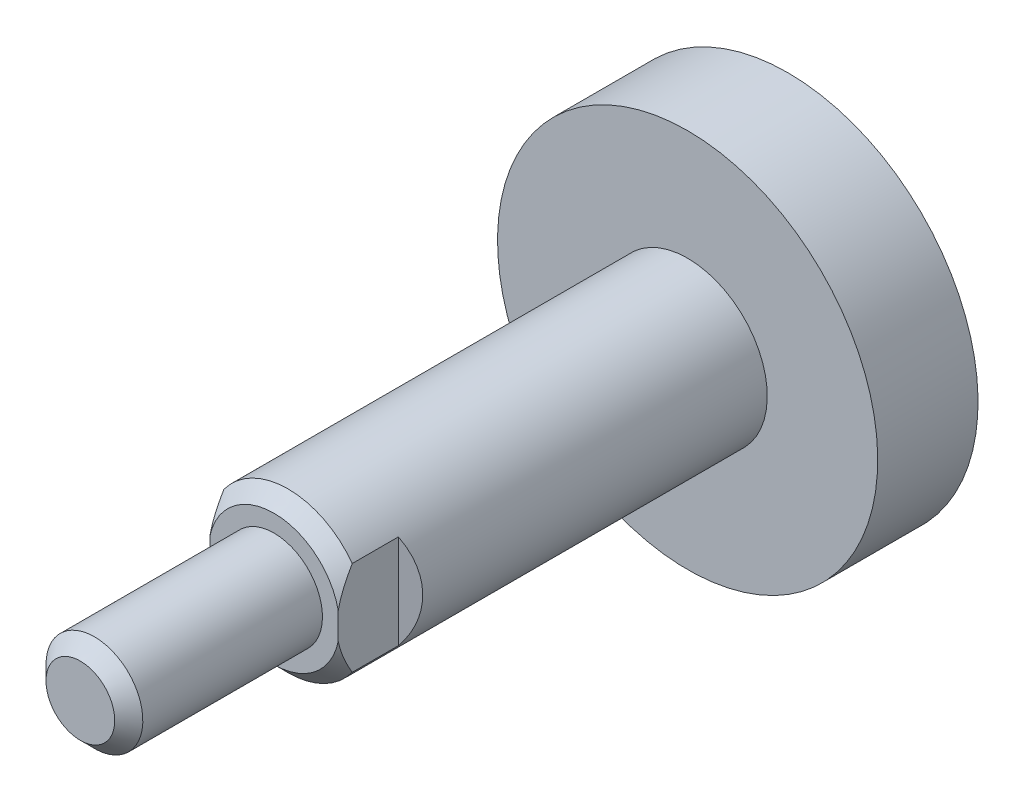
ISO-10303-21;
HEADER;
FILE_DESCRIPTION(('STEP AP214'),'2;1');
FILE_NAME('part.step','',(''),(''),'','','');
FILE_SCHEMA(('AUTOMOTIVE_DESIGN { 1 0 10303 214 1 1 1 1 }'));
ENDSEC;
DATA;
#1=APPLICATION_CONTEXT('core data for automotive mechanical design processes');
#2=APPLICATION_PROTOCOL_DEFINITION('international standard','automotive_design',2000,#1);
#3=PRODUCT_CONTEXT('',#1,'mechanical');
#4=PRODUCT('Part','Part','',(#3));
#5=PRODUCT_RELATED_PRODUCT_CATEGORY('part','',(#4));
#6=PRODUCT_DEFINITION_FORMATION('','',#4);
#7=PRODUCT_DEFINITION_CONTEXT('part definition',#1,'design');
#8=PRODUCT_DEFINITION('design','',#6,#7);
#9=PRODUCT_DEFINITION_SHAPE('','',#8);
#10=(LENGTH_UNIT() NAMED_UNIT(*) SI_UNIT(.MILLI.,.METRE.));
#11=(NAMED_UNIT(*) PLANE_ANGLE_UNIT() SI_UNIT($,.RADIAN.));
#12=(NAMED_UNIT(*) SI_UNIT($,.STERADIAN.) SOLID_ANGLE_UNIT());
#13=UNCERTAINTY_MEASURE_WITH_UNIT(LENGTH_MEASURE(1.E-05),#10,'distance_accuracy_value','');
#14=(GEOMETRIC_REPRESENTATION_CONTEXT(3) GLOBAL_UNCERTAINTY_ASSIGNED_CONTEXT((#13)) GLOBAL_UNIT_ASSIGNED_CONTEXT((#10,
#11,#12)) REPRESENTATION_CONTEXT('',''));
#15=CARTESIAN_POINT('',(0.,0.,0.));
#16=DIRECTION('',(0.,0.,1.));
#17=DIRECTION('',(1.,0.,0.));
#18=AXIS2_PLACEMENT_3D('',#15,#16,#17);
#19=CARTESIAN_POINT('',(0.,0.,35.266));
#20=DIRECTION('',(0.,0.,1.));
#21=DIRECTION('',(0.,-1.,0.));
#22=AXIS2_PLACEMENT_3D('',#19,#20,#21);
#23=PLANE('',#22);
#24=CARTESIAN_POINT('',(0.,0.,35.2659999999219));
#25=DIRECTION('',(0.,0.,-1.));
#26=DIRECTION('',(-1.,0.,0.));
#27=AXIS2_PLACEMENT_3D('',#24,#25,#26);
#28=CIRCLE('',#27,1.71299999999519);
#29=CARTESIAN_POINT('',(-1.71299999999519,0.,35.2659999999219));
#30=VERTEX_POINT('',#29);
#31=EDGE_CURVE('E20',#30,#30,#28,.T.);
#32=ORIENTED_EDGE('',*,*,#31,.F.);
#33=EDGE_LOOP('',(#32));
#34=FACE_BOUND('',#33,.T.);
#35=ADVANCED_FACE('F17',(#34),#23,.T.);
#36=CARTESIAN_POINT('',(0.,0.,34.5660000000407));
#37=DIRECTION('',(0.,0.,-1.));
#38=DIRECTION('',(-1.,0.,0.));
#39=AXIS2_PLACEMENT_3D('',#36,#37,#38);
#40=CONICAL_SURFACE('',#39,2.41299999987632,0.785398163397449);
#41=ORIENTED_EDGE('',*,*,#31,.T.);
#42=EDGE_LOOP('',(#41));
#43=FACE_BOUND('',#42,.T.);
#44=CARTESIAN_POINT('',(0.,0.,34.566));
#45=DIRECTION('',(0.,0.,-1.));
#46=DIRECTION('',(0.,1.,0.));
#47=AXIS2_PLACEMENT_3D('',#44,#45,#46);
#48=CIRCLE('',#47,2.413);
#49=CARTESIAN_POINT('',(0.,2.413,34.566));
#50=VERTEX_POINT('',#49);
#51=EDGE_CURVE('E72',#50,#50,#48,.T.);
#52=ORIENTED_EDGE('',*,*,#51,.F.);
#53=EDGE_LOOP('',(#52));
#54=FACE_BOUND('',#53,.T.);
#55=ADVANCED_FACE('F196',(#43,#54),#40,.T.);
#56=CARTESIAN_POINT('',(0.,0.,35.266));
#57=DIRECTION('',(0.,0.,-1.));
#58=DIRECTION('',(0.,1.,0.));
#59=AXIS2_PLACEMENT_3D('',#56,#57,#58);
#60=CYLINDRICAL_SURFACE('',#59,2.413);
#61=ORIENTED_EDGE('',*,*,#51,.T.);
#62=EDGE_LOOP('',(#61));
#63=FACE_BOUND('',#62,.T.);
#64=CARTESIAN_POINT('',(0.,0.,25.6139999993));
#65=DIRECTION('',(0.,0.,-1.));
#66=DIRECTION('',(0.,1.,0.));
#67=AXIS2_PLACEMENT_3D('',#64,#65,#66);
#68=CIRCLE('',#67,2.413);
#69=CARTESIAN_POINT('',(0.,2.413,25.6139999993));
#70=VERTEX_POINT('',#69);
#71=EDGE_CURVE('E71',#70,#70,#68,.F.);
#72=ORIENTED_EDGE('',*,*,#71,.T.);
#73=EDGE_LOOP('',(#72));
#74=FACE_BOUND('',#73,.T.);
#75=ADVANCED_FACE('F203',(#63,#74),#60,.T.);
#76=CARTESIAN_POINT('',(0.,0.,25.614));
#77=DIRECTION('',(0.,0.,-1.));
#78=DIRECTION('',(0.,1.,0.));
#79=AXIS2_PLACEMENT_3D('',#76,#77,#78);
#80=PLANE('',#79);
#81=ORIENTED_EDGE('',*,*,#71,.F.);
#82=EDGE_LOOP('',(#81));
#83=FACE_BOUND('',#82,.T.);
#84=DIRECTION('',(0.,1.,0.));
#85=VECTOR('',#84,1.);
#86=CARTESIAN_POINT('',(3.2,0.,25.614));
#87=LINE('',#86,#85);
#88=CARTESIAN_POINT('',(3.2,0.668102536058297,25.6140000002083));
#89=VERTEX_POINT('',#88);
#90=CARTESIAN_POINT('',(3.2,-0.668102536058266,25.6140000002083));
#91=VERTEX_POINT('',#90);
#92=EDGE_CURVE('E59',#89,#91,#87,.F.);
#93=ORIENTED_EDGE('',*,*,#92,.F.);
#94=CARTESIAN_POINT('',(0.,0.,25.6140000004166));
#95=DIRECTION('',(0.,0.,-1.));
#96=DIRECTION('',(-1.,0.,0.));
#97=AXIS2_PLACEMENT_3D('',#94,#95,#96);
#98=CIRCLE('',#97,3.26899999959096);
#99=CARTESIAN_POINT('',(-3.2,0.668102536058276,25.6140000002083));
#100=VERTEX_POINT('',#99);
#101=EDGE_CURVE('E92',#100,#89,#98,.T.);
#102=ORIENTED_EDGE('',*,*,#101,.F.);
#103=DIRECTION('',(0.,1.,0.));
#104=VECTOR('',#103,1.);
#105=CARTESIAN_POINT('',(-3.2,-9.475,25.614));
#106=LINE('',#105,#104);
#107=CARTESIAN_POINT('',(-3.2,-0.668102536024577,25.6140000002152));
#108=VERTEX_POINT('',#107);
#109=EDGE_CURVE('E78',#100,#108,#106,.F.);
#110=ORIENTED_EDGE('',*,*,#109,.T.);
#111=CARTESIAN_POINT('',(0.,0.,25.6140000004166));
#112=DIRECTION('',(0.,0.,-1.));
#113=DIRECTION('',(-1.,0.,0.));
#114=AXIS2_PLACEMENT_3D('',#111,#112,#113);
#115=CIRCLE('',#114,3.26899999959096);
#116=EDGE_CURVE('E76',#91,#108,#115,.T.);
#117=ORIENTED_EDGE('',*,*,#116,.F.);
#118=EDGE_LOOP('',(#93,#102,#110,#117));
#119=FACE_BOUND('',#118,.T.);
#120=ADVANCED_FACE('F77',(#83,#119),#80,.F.);
#121=CARTESIAN_POINT('',(0.,0.,24.9139999997965));
#122=DIRECTION('',(0.,0.,-1.));
#123=DIRECTION('',(-1.,0.,0.));
#124=AXIS2_PLACEMENT_3D('',#121,#122,#123);
#125=CONICAL_SURFACE('',#124,3.9690000002679,0.785398163438051);
#126=CARTESIAN_POINT('',(-3.2,-0.668102537010062,25.6140000000138));
#127=CARTESIAN_POINT('',(-3.2,-0.791923989270128,25.5887118948299));
#128=CARTESIAN_POINT('',(-3.2,-0.914214432159039,25.5569533814444));
#129=CARTESIAN_POINT('',(-3.2,-1.15522323063297,25.4827867348233));
#130=CARTESIAN_POINT('',(-3.2,-1.27394966581128,25.440405109442));
#131=CARTESIAN_POINT('',(-3.2,-1.50692397327154,25.3475394481939));
#132=CARTESIAN_POINT('',(-3.2,-1.62120166834068,25.2971285477496));
#133=CARTESIAN_POINT('',(-3.2,-1.84665634639069,25.1897204576055));
#134=CARTESIAN_POINT('',(-3.2,-1.95783200282871,25.1327205021943));
#135=CARTESIAN_POINT('',(-3.2,-2.1147772258615,25.047544782852));
#136=CARTESIAN_POINT('',(-3.2,-2.16170136250099,25.0214620111045));
#137=CARTESIAN_POINT('',(-3.2,-2.25515024773275,24.9683835315851));
#138=CARTESIAN_POINT('',(-3.2,-2.30167405382034,24.9413861633452));
#139=CARTESIAN_POINT('',(-3.2,-2.34796954868399,24.9139999998695));
#140=B_SPLINE_CURVE_WITH_KNOTS('',3,(#126,#127,#128,#129,#130,#131,#132,#133,#134,#135,#136,
#137,#138,#139),.UNSPECIFIED.,.F.,.F.,(4,2,2,2,2,2,4),(0.,0.378663318917436,0.756391005231497,
1.13085654276556,1.50547983434663,1.66653163381116,1.82789340230137),.UNSPECIFIED.);
#141=CARTESIAN_POINT('',(-3.20000000000107,-2.34796954851914,24.9139999995839));
#142=VERTEX_POINT('',#141);
#143=EDGE_CURVE('E117',#108,#142,#140,.T.);
#144=ORIENTED_EDGE('',*,*,#143,.T.);
#145=CARTESIAN_POINT('',(0.,0.,24.9139999993));
#146=DIRECTION('',(0.,0.,-1.));
#147=DIRECTION('',(0.,1.,0.));
#148=AXIS2_PLACEMENT_3D('',#145,#146,#147);
#149=CIRCLE('',#148,3.969);
#150=CARTESIAN_POINT('',(3.20000000000107,-2.34796954851914,24.9139999995839));
#151=VERTEX_POINT('',#150);
#152=EDGE_CURVE('E86',#151,#142,#149,.T.);
#153=ORIENTED_EDGE('',*,*,#152,.F.);
#154=CARTESIAN_POINT('',(3.19999999983626,-2.34796954864309,24.9139999997941));
#155=CARTESIAN_POINT('',(3.19999999993964,-2.2822754066399,24.9528576847096));
#156=CARTESIAN_POINT('',(3.19999999998346,-2.21612013352251,24.9909397041059));
#157=CARTESIAN_POINT('',(3.20000000001654,-2.08277615474813,25.0652931600104));
#158=CARTESIAN_POINT('',(3.20000000000578,-2.01558715542604,25.1015640691062));
#159=CARTESIAN_POINT('',(3.19999999998852,-1.81330543751583,25.2067462963529));
#160=CARTESIAN_POINT('',(3.19999999999672,-1.67658349372597,25.2725768397656));
#161=CARTESIAN_POINT('',(3.20000000000329,-1.39788707511652,25.3932563067828));
#162=CARTESIAN_POINT('',(3.20000000000165,-1.25590184033489,25.4480810763052));
#163=CARTESIAN_POINT('',(3.19999999999834,-0.966123687312233,25.5431571720498));
#164=CARTESIAN_POINT('',(3.19999999999666,-0.818297789234861,25.5833066542657));
#165=CARTESIAN_POINT('',(3.2,-0.668102536381115,25.6140000001423));
#166=B_SPLINE_CURVE_WITH_KNOTS('',3,(#154,#155,#156,#157,#158,#159,#160,#161,#162,#163,#164,
#165),.UNSPECIFIED.,.F.,.F.,(4,2,2,2,2,4),(0.,0.228972156620045,0.458010607780568,
0.912891486954859,1.36876002193486,1.82773469683409),.UNSPECIFIED.);
#167=EDGE_CURVE('E64',#151,#91,#166,.T.);
#168=ORIENTED_EDGE('',*,*,#167,.T.);
#169=ORIENTED_EDGE('',*,*,#116,.T.);
#170=EDGE_LOOP('',(#144,#153,#168,#169));
#171=FACE_BOUND('',#170,.T.);
#172=ADVANCED_FACE('F85',(#171),#125,.T.);
#173=CARTESIAN_POINT('',(3.2,-9.475,22.614));
#174=DIRECTION('',(-0.50000000000019,0.,-0.866025403784329));
#175=DIRECTION('',(-0.866025403784329,0.,0.50000000000019));
#176=AXIS2_PLACEMENT_3D('',#173,#174,#175);
#177=PLANE('',#176);
#178=CARTESIAN_POINT('',(0.,0.,24.4615208614077));
#179=DIRECTION('',(-0.50000000000019,0.,-0.866025403784329));
#180=DIRECTION('',(0.866025403784329,0.,-0.50000000000019));
#181=AXIS2_PLACEMENT_3D('',#178,#179,#180);
#182=ELLIPSE('',#181,4.58300643682783,3.969);
#183=CARTESIAN_POINT('',(3.20000000000107,2.34796954847107,22.6140000001994));
#184=VERTEX_POINT('',#183);
#185=CARTESIAN_POINT('',(3.20000000000107,-2.34796954847106,22.6140000001994));
#186=VERTEX_POINT('',#185);
#187=EDGE_CURVE('E175',#184,#186,#182,.T.);
#188=ORIENTED_EDGE('',*,*,#187,.F.);
#189=DIRECTION('',(0.,-1.,0.));
#190=VECTOR('',#189,1.);
#191=CARTESIAN_POINT('',(3.2,-9.475,22.6140000004));
#192=LINE('',#191,#190);
#193=EDGE_CURVE('E87',#184,#186,#192,.T.);
#194=ORIENTED_EDGE('',*,*,#193,.T.);
#195=EDGE_LOOP('',(#188,#194));
#196=FACE_BOUND('',#195,.T.);
#197=ADVANCED_FACE('F112',(#196),#177,.F.);
#198=CARTESIAN_POINT('',(-3.2,-9.475,22.614));
#199=DIRECTION('',(0.50000000000019,0.,-0.866025403784329));
#200=DIRECTION('',(-0.866025403784329,0.,-0.50000000000019));
#201=AXIS2_PLACEMENT_3D('',#198,#199,#200);
#202=PLANE('',#201);
#203=CARTESIAN_POINT('',(0.,0.,24.4615208614077));
#204=DIRECTION('',(0.50000000000019,0.,-0.866025403784329));
#205=DIRECTION('',(-0.866025403784329,0.,-0.50000000000019));
#206=AXIS2_PLACEMENT_3D('',#203,#204,#205);
#207=ELLIPSE('',#206,4.58300643682783,3.969);
#208=CARTESIAN_POINT('',(-3.20000000000107,-2.34796954847105,22.6140000001994));
#209=VERTEX_POINT('',#208);
#210=CARTESIAN_POINT('',(-3.20000000000107,2.34796954847106,22.6140000001994));
#211=VERTEX_POINT('',#210);
#212=EDGE_CURVE('E172',#209,#211,#207,.T.);
#213=ORIENTED_EDGE('',*,*,#212,.F.);
#214=DIRECTION('',(0.,1.,0.));
#215=VECTOR('',#214,1.);
#216=CARTESIAN_POINT('',(-3.2,-9.475,22.6140000004));
#217=LINE('',#216,#215);
#218=EDGE_CURVE('E82',#209,#211,#217,.T.);
#219=ORIENTED_EDGE('',*,*,#218,.T.);
#220=EDGE_LOOP('',(#213,#219));
#221=FACE_BOUND('',#220,.T.);
#222=ADVANCED_FACE('F130',(#221),#202,.F.);
#223=CARTESIAN_POINT('',(-3.2,-9.475,25.614));
#224=DIRECTION('',(1.,0.,0.));
#225=DIRECTION('',(0.,1.,0.));
#226=AXIS2_PLACEMENT_3D('',#223,#224,#225);
#227=PLANE('',#226);
#228=ORIENTED_EDGE('',*,*,#143,.F.);
#229=ORIENTED_EDGE('',*,*,#109,.F.);
#230=CARTESIAN_POINT('',(-3.19999999983061,2.34796954862929,24.9139999997988));
#231=CARTESIAN_POINT('',(-3.19999999993756,2.28227540662745,24.9528576847156));
#232=CARTESIAN_POINT('',(-3.19999999998289,2.21612013351088,24.9909397041122));
#233=CARTESIAN_POINT('',(-3.20000000001711,2.08277615473766,25.0652931600164));
#234=CARTESIAN_POINT('',(-3.20000000000598,2.01558715541593,25.1015640691117));
#235=CARTESIAN_POINT('',(-3.19999999998813,1.81330543750692,25.2067462963571));
#236=CARTESIAN_POINT('',(-3.1999999999966,1.67658349371808,25.2725768397692));
#237=CARTESIAN_POINT('',(-3.20000000000341,1.3978870751107,25.3932563067852));
#238=CARTESIAN_POINT('',(-3.20000000000171,1.25590184033013,25.448081076307));
#239=CARTESIAN_POINT('',(-3.19999999999828,0.966123687309641,25.5431571720504));
#240=CARTESIAN_POINT('',(-3.19999999999655,0.818297789233383,25.583306654266));
#241=CARTESIAN_POINT('',(-3.2,0.668102536380836,25.6140000001424));
#242=B_SPLINE_CURVE_WITH_KNOTS('',3,(#230,#231,#232,#233,#234,#235,#236,#237,#238,#239,#240,
#241),.UNSPECIFIED.,.F.,.F.,(4,2,2,2,2,4),(0.,0.228972156618382,0.458010607777197,
0.912891486948037,1.3687600219244,1.82773469682007),.UNSPECIFIED.);
#243=CARTESIAN_POINT('',(-3.20000000000214,2.34796954835157,24.9139999996822));
#244=VERTEX_POINT('',#243);
#245=EDGE_CURVE('E122',#244,#100,#242,.T.);
#246=ORIENTED_EDGE('',*,*,#245,.F.);
#247=DIRECTION('',(0.,0.,-1.));
#248=VECTOR('',#247,1.);
#249=CARTESIAN_POINT('',(-3.20000000000214,2.34796954835157,36.8400272581));
#250=LINE('',#249,#248);
#251=EDGE_CURVE('E174',#211,#244,#250,.F.);
#252=ORIENTED_EDGE('',*,*,#251,.F.);
#253=ORIENTED_EDGE('',*,*,#218,.F.);
#254=DIRECTION('',(0.,0.,-1.));
#255=VECTOR('',#254,1.);
#256=CARTESIAN_POINT('',(-3.20000000000214,-2.34796954835157,36.8400272581));
#257=LINE('',#256,#255);
#258=EDGE_CURVE('E177',#142,#209,#257,.T.);
#259=ORIENTED_EDGE('',*,*,#258,.F.);
#260=EDGE_LOOP('',(#228,#229,#246,#252,#253,#259));
#261=FACE_BOUND('',#260,.T.);
#262=ADVANCED_FACE('F126',(#261),#227,.F.);
#263=CARTESIAN_POINT('',(0.,0.,24.9139999997965));
#264=DIRECTION('',(0.,0.,-1.));
#265=DIRECTION('',(-1.,0.,0.));
#266=AXIS2_PLACEMENT_3D('',#263,#264,#265);
#267=CONICAL_SURFACE('',#266,3.9690000002679,0.785398163438051);
#268=ORIENTED_EDGE('',*,*,#245,.T.);
#269=ORIENTED_EDGE('',*,*,#101,.T.);
#270=CARTESIAN_POINT('',(3.2,0.668102537010064,25.6140000000138));
#271=CARTESIAN_POINT('',(3.2,0.791923989270131,25.5887118948299));
#272=CARTESIAN_POINT('',(3.2,0.914214432159041,25.5569533814444));
#273=CARTESIAN_POINT('',(3.2,1.15522323063297,25.4827867348233));
#274=CARTESIAN_POINT('',(3.2,1.27394966581128,25.440405109442));
#275=CARTESIAN_POINT('',(3.2,1.50692397327154,25.3475394481939));
#276=CARTESIAN_POINT('',(3.2,1.62120166834067,25.2971285477496));
#277=CARTESIAN_POINT('',(3.2,1.84665634639068,25.1897204576055));
#278=CARTESIAN_POINT('',(3.2,1.95783200282871,25.1327205021944));
#279=CARTESIAN_POINT('',(3.2,2.11477722586149,25.047544782852));
#280=CARTESIAN_POINT('',(3.2,2.16170136250099,25.0214620111045));
#281=CARTESIAN_POINT('',(3.2,2.25515024773276,24.9683835315851));
#282=CARTESIAN_POINT('',(3.2,2.30167405382034,24.9413861633453));
#283=CARTESIAN_POINT('',(3.2,2.34796954868399,24.9139999998695));
#284=B_SPLINE_CURVE_WITH_KNOTS('',3,(#270,#271,#272,#273,#274,#275,#276,#277,#278,#279,#280,
#281,#282,#283),.UNSPECIFIED.,.F.,.F.,(4,2,2,2,2,2,4),(0.,0.378663318917435,0.756391005231494,
1.13085654276556,1.50547983434663,1.66653163381116,1.82789340230138),.UNSPECIFIED.);
#285=CARTESIAN_POINT('',(3.20000000000107,2.34796954851915,24.9139999995839));
#286=VERTEX_POINT('',#285);
#287=EDGE_CURVE('E67',#89,#286,#284,.T.);
#288=ORIENTED_EDGE('',*,*,#287,.T.);
#289=CARTESIAN_POINT('',(0.,0.,24.9139999993));
#290=DIRECTION('',(0.,0.,-1.));
#291=DIRECTION('',(0.,1.,0.));
#292=AXIS2_PLACEMENT_3D('',#289,#290,#291);
#293=CIRCLE('',#292,3.969);
#294=EDGE_CURVE('E35',#244,#286,#293,.T.);
#295=ORIENTED_EDGE('',*,*,#294,.F.);
#296=EDGE_LOOP('',(#268,#269,#288,#295));
#297=FACE_BOUND('',#296,.T.);
#298=ADVANCED_FACE('F129',(#297),#267,.T.);
#299=CARTESIAN_POINT('',(3.2,-9.475,25.614));
#300=DIRECTION('',(-1.,0.,0.));
#301=DIRECTION('',(0.,-1.,0.));
#302=AXIS2_PLACEMENT_3D('',#299,#300,#301);
#303=PLANE('',#302);
#304=ORIENTED_EDGE('',*,*,#287,.F.);
#305=ORIENTED_EDGE('',*,*,#92,.T.);
#306=ORIENTED_EDGE('',*,*,#167,.F.);
#307=DIRECTION('',(0.,0.,-1.));
#308=VECTOR('',#307,1.);
#309=CARTESIAN_POINT('',(3.20000000000214,-2.34796954835157,36.8400272581));
#310=LINE('',#309,#308);
#311=EDGE_CURVE('E89',#186,#151,#310,.F.);
#312=ORIENTED_EDGE('',*,*,#311,.F.);
#313=ORIENTED_EDGE('',*,*,#193,.F.);
#314=DIRECTION('',(0.,0.,-1.));
#315=VECTOR('',#314,1.);
#316=CARTESIAN_POINT('',(3.20000000000215,2.34796954835158,36.8400272581));
#317=LINE('',#316,#315);
#318=EDGE_CURVE('E166',#286,#184,#317,.T.);
#319=ORIENTED_EDGE('',*,*,#318,.F.);
#320=EDGE_LOOP('',(#304,#305,#306,#312,#313,#319));
#321=FACE_BOUND('',#320,.T.);
#322=ADVANCED_FACE('F61',(#321),#303,.F.);
#323=CARTESIAN_POINT('',(0.,0.,36.8400272581));
#324=DIRECTION('',(0.,0.,-1.));
#325=DIRECTION('',(0.,1.,0.));
#326=AXIS2_PLACEMENT_3D('',#323,#324,#325);
#327=CYLINDRICAL_SURFACE('',#326,3.969);
#328=CARTESIAN_POINT('',(0.,0.,5.00000000032));
#329=DIRECTION('',(0.,0.,-1.));
#330=DIRECTION('',(0.,1.,0.));
#331=AXIS2_PLACEMENT_3D('',#328,#329,#330);
#332=CIRCLE('',#331,3.969);
#333=CARTESIAN_POINT('',(0.,3.96900000000001,5.00000000032));
#334=VERTEX_POINT('',#333);
#335=EDGE_CURVE('E165',#334,#334,#332,.T.);
#336=ORIENTED_EDGE('',*,*,#335,.F.);
#337=EDGE_LOOP('',(#336));
#338=FACE_BOUND('',#337,.T.);
#339=ORIENTED_EDGE('',*,*,#294,.T.);
#340=ORIENTED_EDGE('',*,*,#318,.T.);
#341=ORIENTED_EDGE('',*,*,#187,.T.);
#342=ORIENTED_EDGE('',*,*,#311,.T.);
#343=ORIENTED_EDGE('',*,*,#152,.T.);
#344=ORIENTED_EDGE('',*,*,#258,.T.);
#345=ORIENTED_EDGE('',*,*,#212,.T.);
#346=ORIENTED_EDGE('',*,*,#251,.T.);
#347=EDGE_LOOP('',(#339,#340,#341,#342,#343,#344,#345,#346));
#348=FACE_BOUND('',#347,.T.);
#349=ADVANCED_FACE('F156',(#338,#348),#327,.T.);
#350=CARTESIAN_POINT('',(0.,0.,5.));
#351=DIRECTION('',(0.,0.,1.));
#352=DIRECTION('',(0.,-1.,0.));
#353=AXIS2_PLACEMENT_3D('',#350,#351,#352);
#354=PLANE('',#353);
#355=ORIENTED_EDGE('',*,*,#335,.T.);
#356=EDGE_LOOP('',(#355));
#357=FACE_BOUND('',#356,.T.);
#358=CARTESIAN_POINT('',(0.,0.,5.));
#359=DIRECTION('',(0.,0.,-1.));
#360=DIRECTION('',(0.,1.,0.));
#361=AXIS2_PLACEMENT_3D('',#358,#359,#360);
#362=CIRCLE('',#361,9.475);
#363=CARTESIAN_POINT('',(0.,9.475,5.));
#364=VERTEX_POINT('',#363);
#365=EDGE_CURVE('E26',#364,#364,#362,.T.);
#366=ORIENTED_EDGE('',*,*,#365,.F.);
#367=EDGE_LOOP('',(#366));
#368=FACE_BOUND('',#367,.T.);
#369=ADVANCED_FACE('F150',(#357,#368),#354,.T.);
#370=CARTESIAN_POINT('',(0.,0.,5.));
#371=DIRECTION('',(0.,0.,-1.));
#372=DIRECTION('',(0.,1.,0.));
#373=AXIS2_PLACEMENT_3D('',#370,#371,#372);
#374=CYLINDRICAL_SURFACE('',#373,9.475);
#375=ORIENTED_EDGE('',*,*,#365,.T.);
#376=EDGE_LOOP('',(#375));
#377=FACE_BOUND('',#376,.T.);
#378=CARTESIAN_POINT('',(0.,0.,0.));
#379=DIRECTION('',(0.,0.,-1.));
#380=DIRECTION('',(0.,1.,0.));
#381=AXIS2_PLACEMENT_3D('',#378,#379,#380);
#382=CIRCLE('',#381,9.475);
#383=CARTESIAN_POINT('',(0.,9.475,0.));
#384=VERTEX_POINT('',#383);
#385=EDGE_CURVE('E11',#384,#384,#382,.F.);
#386=ORIENTED_EDGE('',*,*,#385,.T.);
#387=EDGE_LOOP('',(#386));
#388=FACE_BOUND('',#387,.T.);
#389=ADVANCED_FACE('F144',(#377,#388),#374,.T.);
#390=CARTESIAN_POINT('',(0.,0.,0.));
#391=DIRECTION('',(0.,0.,1.));
#392=DIRECTION('',(0.,-1.,0.));
#393=AXIS2_PLACEMENT_3D('',#390,#391,#392);
#394=PLANE('',#393);
#395=ORIENTED_EDGE('',*,*,#385,.F.);
#396=EDGE_LOOP('',(#395));
#397=FACE_BOUND('',#396,.T.);
#398=ADVANCED_FACE('F142',(#397),#394,.F.);
#399=CLOSED_SHELL('',(#35,#55,#75,#120,#172,#197,#222,#262,#298,#322,#349,#369,#389,#398));
#400=MANIFOLD_SOLID_BREP('B1',#399);
#401=ADVANCED_BREP_SHAPE_REPRESENTATION('',(#18,#400),#14);
#402=SHAPE_DEFINITION_REPRESENTATION(#9,#401);
ENDSEC;
END-ISO-10303-21;
